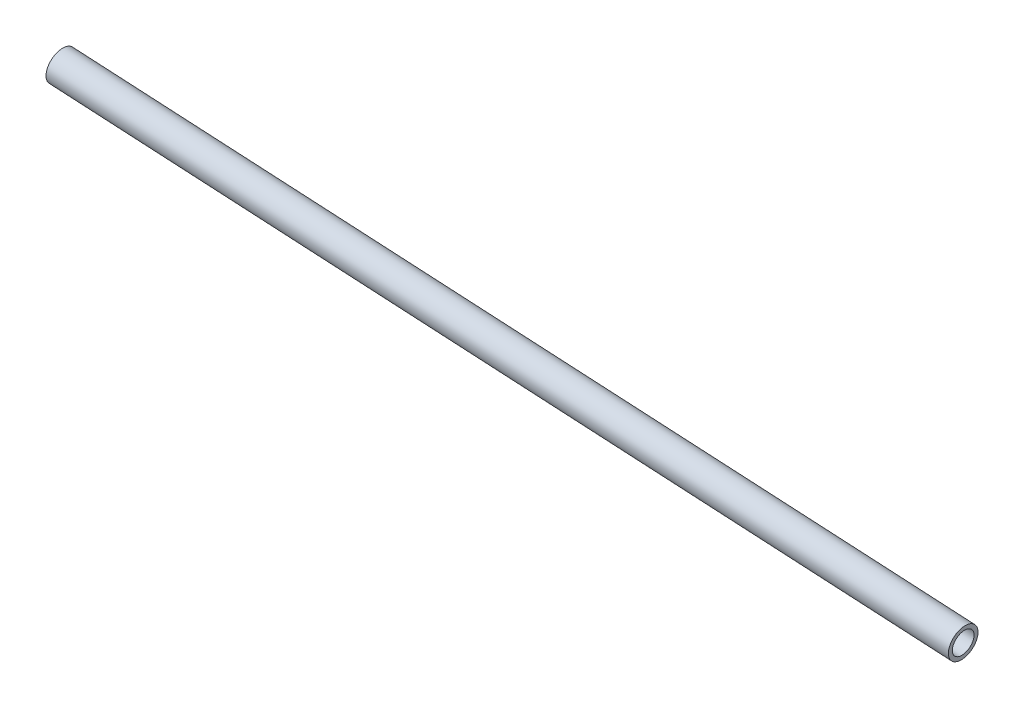
ISO-10303-21;
HEADER;
FILE_DESCRIPTION(('STEP AP214'),'2;1');
FILE_NAME('part.step','',(''),(''),'','','');
FILE_SCHEMA(('AUTOMOTIVE_DESIGN { 1 0 10303 214 1 1 1 1 }'));
ENDSEC;
DATA;
#1=APPLICATION_CONTEXT('core data for automotive mechanical design processes');
#2=APPLICATION_PROTOCOL_DEFINITION('international standard','automotive_design',2000,#1);
#3=PRODUCT_CONTEXT('',#1,'mechanical');
#4=PRODUCT('Part','Part','',(#3));
#5=PRODUCT_RELATED_PRODUCT_CATEGORY('part','',(#4));
#6=PRODUCT_DEFINITION_FORMATION('','',#4);
#7=PRODUCT_DEFINITION_CONTEXT('part definition',#1,'design');
#8=PRODUCT_DEFINITION('design','',#6,#7);
#9=PRODUCT_DEFINITION_SHAPE('','',#8);
#10=(LENGTH_UNIT() NAMED_UNIT(*) SI_UNIT(.MILLI.,.METRE.));
#11=(NAMED_UNIT(*) PLANE_ANGLE_UNIT() SI_UNIT($,.RADIAN.));
#12=(NAMED_UNIT(*) SI_UNIT($,.STERADIAN.) SOLID_ANGLE_UNIT());
#13=UNCERTAINTY_MEASURE_WITH_UNIT(LENGTH_MEASURE(1.E-05),#10,'distance_accuracy_value','');
#14=(GEOMETRIC_REPRESENTATION_CONTEXT(3) GLOBAL_UNCERTAINTY_ASSIGNED_CONTEXT((#13)) GLOBAL_UNIT_ASSIGNED_CONTEXT((#10,
#11,#12)) REPRESENTATION_CONTEXT('',''));
#15=CARTESIAN_POINT('',(0.,0.,0.));
#16=DIRECTION('',(0.,0.,1.));
#17=DIRECTION('',(1.,0.,0.));
#18=AXIS2_PLACEMENT_3D('',#15,#16,#17);
#19=CARTESIAN_POINT('',(737.463178652276,-48.7125012364313,-18.0910891039654));
#20=DIRECTION('',(-0.995519937083636,0.0886608648569889,0.0328527915374742));
#21=DIRECTION('',(-0.0887087497200819,-0.996057607632761,0.));
#22=AXIS2_PLACEMENT_3D('',#19,#20,#21);
#23=CYLINDRICAL_SURFACE('',#22,6.985);
#24=CARTESIAN_POINT('',(737.463178652276,-48.7125012364313,-18.0910891039654));
#25=DIRECTION('',(0.995519937083636,-0.0886608648569889,-0.0328527915374742));
#26=DIRECTION('',(0.0887087497200819,0.996057607632761,0.));
#27=AXIS2_PLACEMENT_3D('',#24,#25,#26);
#28=CIRCLE('',#27,6.985);
#29=CARTESIAN_POINT('',(736.843548035482,-55.6699636257462,-18.0910891039654));
#30=VERTEX_POINT('',#29);
#31=EDGE_CURVE('E56',#30,#30,#28,.T.);
#32=CARTESIAN_POINT('',(192.7225,-0.197973407305246,-0.114299999999943));
#33=DIRECTION('',(0.995519937083636,-0.0886608648569889,-0.0328527915374742));
#34=DIRECTION('',(0.0887087497200819,0.996057607632761,0.));
#35=AXIS2_PLACEMENT_3D('',#32,#33,#34);
#36=CIRCLE('',#35,6.985);
#37=CARTESIAN_POINT('',(192.102869383205,-7.15543579662009,-0.114299999999946));
#38=VERTEX_POINT('',#37);
#39=EDGE_CURVE('E63',#38,#38,#36,.T.);
#40=CARTESIAN_POINT('',(736.843548035482,-55.6699636257462,-18.0910891039654));
#41=CARTESIAN_POINT('',(731.169165966187,-55.1646039608595,-17.9038308841324));
#42=CARTESIAN_POINT('',(725.494783896893,-54.6592442959727,-17.7165726642995));
#43=CARTESIAN_POINT('',(714.146019758304,-53.6485249661993,-17.3420562246335));
#44=CARTESIAN_POINT('',(708.471637689009,-53.1431653013125,-17.1547980048005));
#45=CARTESIAN_POINT('',(697.12287355042,-52.1324459715391,-16.7802815651346));
#46=CARTESIAN_POINT('',(691.448491481125,-51.6270863066523,-16.5930233453016));
#47=CARTESIAN_POINT('',(680.099727342536,-50.6163669768789,-16.2185069056357));
#48=CARTESIAN_POINT('',(674.425345273242,-50.1110073119921,-16.0312486858027));
#49=CARTESIAN_POINT('',(663.076581134653,-49.1002879822187,-15.6567322461367));
#50=CARTESIAN_POINT('',(657.402199065358,-48.594928317332,-15.4694740263038));
#51=CARTESIAN_POINT('',(646.053434926769,-47.5842089875585,-15.0949575866378));
#52=CARTESIAN_POINT('',(640.379052857474,-47.0788493226718,-14.9076993668049));
#53=CARTESIAN_POINT('',(629.030288718885,-46.0681299928983,-14.5331829271389));
#54=CARTESIAN_POINT('',(623.355906649591,-45.5627703280116,-14.3459247073059));
#55=CARTESIAN_POINT('',(612.007142511002,-44.5520509982381,-13.97140826764));
#56=CARTESIAN_POINT('',(606.332760441707,-44.0466913333514,-13.784150047807));
#57=CARTESIAN_POINT('',(594.983996303118,-43.0359720035779,-13.4096336081411));
#58=CARTESIAN_POINT('',(589.309614233823,-42.5306123386912,-13.2223753883081));
#59=CARTESIAN_POINT('',(577.960850095234,-41.5198930089177,-12.8478589486421));
#60=CARTESIAN_POINT('',(572.28646802594,-41.014533344031,-12.6606007288092));
#61=CARTESIAN_POINT('',(560.937703887351,-40.0038140142575,-12.2860842891432));
#62=CARTESIAN_POINT('',(555.263321818056,-39.4984543493708,-12.0988260693103));
#63=CARTESIAN_POINT('',(543.914557679467,-38.4877350195974,-11.7243096296443));
#64=CARTESIAN_POINT('',(538.240175610173,-37.9823753547106,-11.5370514098113));
#65=CARTESIAN_POINT('',(526.891411471584,-36.9716560249372,-11.1625349701454));
#66=CARTESIAN_POINT('',(521.217029402289,-36.4662963600504,-10.9752767503124));
#67=CARTESIAN_POINT('',(509.8682652637,-35.455577030277,-10.6007603106465));
#68=CARTESIAN_POINT('',(504.193883194405,-34.9502173653902,-10.4135020908135));
#69=CARTESIAN_POINT('',(492.845119055816,-33.9394980356168,-10.0389856511475));
#70=CARTESIAN_POINT('',(487.170736986522,-33.4341383707301,-9.85172743131457));
#71=CARTESIAN_POINT('',(475.821972847933,-32.4234190409566,-9.47721099164862));
#72=CARTESIAN_POINT('',(470.147590778638,-31.9180593760699,-9.28995277181565));
#73=CARTESIAN_POINT('',(458.798826640049,-30.9073400462964,-8.9154363321497));
#74=CARTESIAN_POINT('',(453.124444570754,-30.4019803814097,-8.72817811231673));
#75=CARTESIAN_POINT('',(441.775680432165,-29.3912610516362,-8.35366167265078));
#76=CARTESIAN_POINT('',(436.101298362871,-28.8859013867495,-8.16640345281781));
#77=CARTESIAN_POINT('',(424.752534224282,-27.875182056976,-7.79188701315186));
#78=CARTESIAN_POINT('',(419.078152154987,-27.3698223920893,-7.60462879331889));
#79=CARTESIAN_POINT('',(407.729388016398,-26.3591030623158,-7.23011235365294));
#80=CARTESIAN_POINT('',(402.055005947103,-25.8537433974291,-7.04285413381997));
#81=CARTESIAN_POINT('',(390.706241808514,-24.8430240676556,-6.66833769415402));
#82=CARTESIAN_POINT('',(385.03185973922,-24.3376644027689,-6.48107947432104));
#83=CARTESIAN_POINT('',(373.683095600631,-23.3269450729955,-6.1065630346551));
#84=CARTESIAN_POINT('',(368.008713531336,-22.8215854081087,-5.91930481482212));
#85=CARTESIAN_POINT('',(356.659949392747,-21.8108660783353,-5.54478837515618));
#86=CARTESIAN_POINT('',(350.985567323453,-21.3055064134485,-5.3575301553232));
#87=CARTESIAN_POINT('',(339.636803184863,-20.2947870836751,-4.98301371565725));
#88=CARTESIAN_POINT('',(333.962421115569,-19.7894274187883,-4.79575549582428));
#89=CARTESIAN_POINT('',(322.61365697698,-18.7787080890149,-4.42123905615834));
#90=CARTESIAN_POINT('',(316.939274907685,-18.2733484241282,-4.23398083632536));
#91=CARTESIAN_POINT('',(305.590510769096,-17.2626290943547,-3.85946439665942));
#92=CARTESIAN_POINT('',(299.916128699802,-16.757269429468,-3.67220617682644));
#93=CARTESIAN_POINT('',(288.567364561213,-15.7465500996945,-3.2976897371605));
#94=CARTESIAN_POINT('',(282.892982491918,-15.2411904348078,-3.11043151732752));
#95=CARTESIAN_POINT('',(271.544218353329,-14.2304711050343,-2.73591507766157));
#96=CARTESIAN_POINT('',(265.869836284034,-13.7251114401476,-2.5486568578286));
#97=CARTESIAN_POINT('',(254.521072145445,-12.7143921103741,-2.17414041816265));
#98=CARTESIAN_POINT('',(248.846690076151,-12.2090324454874,-1.98688219832968));
#99=CARTESIAN_POINT('',(237.497925937562,-11.1983131157139,-1.61236575866373));
#100=CARTESIAN_POINT('',(231.823543868267,-10.6929534508272,-1.42510753883076));
#101=CARTESIAN_POINT('',(220.474779729678,-9.68223412105374,-1.05059109916482));
#102=CARTESIAN_POINT('',(214.800397660383,-9.17687445616701,-0.863332879331839));
#103=CARTESIAN_POINT('',(203.451633521794,-8.16615512639356,-0.48881643966589));
#104=CARTESIAN_POINT('',(197.7772514525,-7.66079546150682,-0.301558219832916));
#105=CARTESIAN_POINT('',(192.102869383205,-7.15543579662009,-0.114299999999946));
#106=B_SPLINE_CURVE_WITH_KNOTS('',3,(#40,#41,#42,#43,#44,#45,#46,#47,#48,#49,#50,#51,#52,#53,
#54,#55,#56,#57,#58,#59,#60,#61,#62,#63,#64,#65,#66,#67,#68,#69,#70,#71,#72,#73,#74,#75,#76,#77,
#78,#79,#80,#81,#82,#83,#84,#85,#86,#87,#88,#89,#90,#91,#92,#93,#94,#95,#96,#97,#98,#99,#100,
#101,#102,#103,#104,#105),.UNSPECIFIED.,.F.,.F.,(4,2,2,2,2,2,2,2,2,2,2,2,2,2,2,2,2,2,2,2,2,2,2,
2,2,2,2,2,2,2,2,2,4),(0.,17.0997541824756,34.199508364951,51.2992625474265,68.399016729902,
85.4987709123775,102.598525094853,119.698279277328,136.798033459804,153.89778764228,
170.997541824755,188.09729600723,205.197050189706,222.296804372181,239.396558554657,
256.496312737132,273.596066919608,290.695821102083,307.795575284559,324.895329467034,
341.99508364951,359.094837831985,376.194592014461,393.294346196936,410.394100379412,
427.493854561887,444.593608744363,461.693362926838,478.793117109314,495.892871291789,
512.992625474265,530.09237965674,547.192133839216),.UNSPECIFIED.);
#107=EDGE_CURVE('BSEAM48',#30,#38,#106,.T.);
#108=ORIENTED_EDGE('',*,*,#31,.T.);
#109=ORIENTED_EDGE('',*,*,#39,.F.);
#110=ORIENTED_EDGE('',*,*,#107,.T.);
#111=ORIENTED_EDGE('',*,*,#107,.F.);
#112=EDGE_LOOP('',(#108,#110,#109,#111));
#113=FACE_BOUND('',#112,.T.);
#114=ADVANCED_FACE('F48',(#113),#23,.F.);
#115=CARTESIAN_POINT('',(737.463178652276,-48.7125012364313,-18.0910891039654));
#116=DIRECTION('',(-0.995519937083636,0.0886608648569889,0.0328527915374742));
#117=DIRECTION('',(-0.0887087497200819,-0.996057607632761,0.));
#118=AXIS2_PLACEMENT_3D('',#115,#116,#117);
#119=CYLINDRICAL_SURFACE('',#118,9.525);
#120=CARTESIAN_POINT('',(737.463178652276,-48.7125012364313,-18.0910891039654));
#121=DIRECTION('',(0.995519937083636,-0.0886608648569889,-0.0328527915374742));
#122=DIRECTION('',(0.0887087497200819,0.996057607632761,0.));
#123=AXIS2_PLACEMENT_3D('',#120,#121,#122);
#124=CIRCLE('',#123,9.525);
#125=CARTESIAN_POINT('',(736.618227811193,-58.1999499491334,-18.0910891039654));
#126=VERTEX_POINT('',#125);
#127=EDGE_CURVE('E11',#126,#126,#124,.T.);
#128=CARTESIAN_POINT('',(192.7225,-0.197973407305246,-0.114299999999943));
#129=DIRECTION('',(0.995519937083636,-0.0886608648569889,-0.0328527915374742));
#130=DIRECTION('',(0.0887087497200819,0.996057607632761,0.));
#131=AXIS2_PLACEMENT_3D('',#128,#129,#130);
#132=CIRCLE('',#131,9.525);
#133=CARTESIAN_POINT('',(191.877549158916,-9.6854221200073,-0.114299999999946));
#134=VERTEX_POINT('',#133);
#135=EDGE_CURVE('E51',#134,#134,#132,.T.);
#136=CARTESIAN_POINT('',(736.618227811193,-58.1999499491334,-18.0910891039654));
#137=CARTESIAN_POINT('',(730.943845741898,-57.6945902842467,-17.9038308841324));
#138=CARTESIAN_POINT('',(725.269463672604,-57.1892306193599,-17.7165726642995));
#139=CARTESIAN_POINT('',(713.920699534014,-56.1785112895865,-17.3420562246335));
#140=CARTESIAN_POINT('',(708.24631746472,-55.6731516246997,-17.1547980048005));
#141=CARTESIAN_POINT('',(696.897553326131,-54.6624322949263,-16.7802815651346));
#142=CARTESIAN_POINT('',(691.223171256836,-54.1570726300396,-16.5930233453016));
#143=CARTESIAN_POINT('',(679.874407118247,-53.1463533002661,-16.2185069056357));
#144=CARTESIAN_POINT('',(674.200025048953,-52.6409936353794,-16.0312486858027));
#145=CARTESIAN_POINT('',(662.851260910364,-51.6302743056059,-15.6567322461367));
#146=CARTESIAN_POINT('',(657.176878841069,-51.1249146407192,-15.4694740263038));
#147=CARTESIAN_POINT('',(645.82811470248,-50.1141953109457,-15.0949575866378));
#148=CARTESIAN_POINT('',(640.153732633185,-49.608835646059,-14.9076993668049));
#149=CARTESIAN_POINT('',(628.804968494596,-48.5981163162855,-14.5331829271389));
#150=CARTESIAN_POINT('',(623.130586425302,-48.0927566513988,-14.3459247073059));
#151=CARTESIAN_POINT('',(611.781822286713,-47.0820373216253,-13.97140826764));
#152=CARTESIAN_POINT('',(606.107440217418,-46.5766776567386,-13.784150047807));
#153=CARTESIAN_POINT('',(594.758676078829,-45.5659583269651,-13.4096336081411));
#154=CARTESIAN_POINT('',(589.084294009534,-45.0605986620784,-13.2223753883081));
#155=CARTESIAN_POINT('',(577.735529870945,-44.049879332305,-12.8478589486421));
#156=CARTESIAN_POINT('',(572.061147801651,-43.5445196674182,-12.6606007288092));
#157=CARTESIAN_POINT('',(560.712383663062,-42.5338003376448,-12.2860842891432));
#158=CARTESIAN_POINT('',(555.038001593767,-42.028440672758,-12.0988260693103));
#159=CARTESIAN_POINT('',(543.689237455178,-41.0177213429846,-11.7243096296443));
#160=CARTESIAN_POINT('',(538.014855385884,-40.5123616780978,-11.5370514098113));
#161=CARTESIAN_POINT('',(526.666091247295,-39.5016423483244,-11.1625349701454));
#162=CARTESIAN_POINT('',(520.991709178,-38.9962826834377,-10.9752767503124));
#163=CARTESIAN_POINT('',(509.642945039411,-37.9855633536642,-10.6007603106465));
#164=CARTESIAN_POINT('',(503.968562970116,-37.4802036887775,-10.4135020908135));
#165=CARTESIAN_POINT('',(492.619798831527,-36.469484359004,-10.0389856511475));
#166=CARTESIAN_POINT('',(486.945416762233,-35.9641246941173,-9.85172743131457));
#167=CARTESIAN_POINT('',(475.596652623644,-34.9534053643438,-9.47721099164862));
#168=CARTESIAN_POINT('',(469.922270554349,-34.4480456994571,-9.28995277181565));
#169=CARTESIAN_POINT('',(458.57350641576,-33.4373263696836,-8.9154363321497));
#170=CARTESIAN_POINT('',(452.899124346465,-32.9319667047969,-8.72817811231673));
#171=CARTESIAN_POINT('',(441.550360207876,-31.9212473750234,-8.35366167265078));
#172=CARTESIAN_POINT('',(435.875978138582,-31.4158877101367,-8.16640345281781));
#173=CARTESIAN_POINT('',(424.527213999993,-30.4051683803632,-7.79188701315186));
#174=CARTESIAN_POINT('',(418.852831930698,-29.8998087154765,-7.60462879331889));
#175=CARTESIAN_POINT('',(407.504067792109,-28.889089385703,-7.23011235365294));
#176=CARTESIAN_POINT('',(401.829685722814,-28.3837297208163,-7.04285413381997));
#177=CARTESIAN_POINT('',(390.480921584225,-27.3730103910429,-6.66833769415402));
#178=CARTESIAN_POINT('',(384.806539514931,-26.8676507261561,-6.48107947432104));
#179=CARTESIAN_POINT('',(373.457775376342,-25.8569313963827,-6.1065630346551));
#180=CARTESIAN_POINT('',(367.783393307047,-25.3515717314959,-5.91930481482212));
#181=CARTESIAN_POINT('',(356.434629168458,-24.3408524017225,-5.54478837515618));
#182=CARTESIAN_POINT('',(350.760247099164,-23.8354927368357,-5.3575301553232));
#183=CARTESIAN_POINT('',(339.411482960574,-22.8247734070623,-4.98301371565725));
#184=CARTESIAN_POINT('',(333.73710089128,-22.3194137421755,-4.79575549582428));
#185=CARTESIAN_POINT('',(322.388336752691,-21.3086944124021,-4.42123905615834));
#186=CARTESIAN_POINT('',(316.713954683396,-20.8033347475154,-4.23398083632536));
#187=CARTESIAN_POINT('',(305.365190544807,-19.7926154177419,-3.85946439665942));
#188=CARTESIAN_POINT('',(299.690808475513,-19.2872557528552,-3.67220617682644));
#189=CARTESIAN_POINT('',(288.342044336924,-18.2765364230817,-3.2976897371605));
#190=CARTESIAN_POINT('',(282.667662267629,-17.771176758195,-3.11043151732752));
#191=CARTESIAN_POINT('',(271.31889812904,-16.7604574284215,-2.73591507766157));
#192=CARTESIAN_POINT('',(265.644516059745,-16.2550977635348,-2.5486568578286));
#193=CARTESIAN_POINT('',(254.295751921156,-15.2443784337613,-2.17414041816265));
#194=CARTESIAN_POINT('',(248.621369851862,-14.7390187688746,-1.98688219832968));
#195=CARTESIAN_POINT('',(237.272605713273,-13.7282994391011,-1.61236575866373));
#196=CARTESIAN_POINT('',(231.598223643978,-13.2229397742144,-1.42510753883076));
#197=CARTESIAN_POINT('',(220.249459505389,-12.212220444441,-1.05059109916482));
#198=CARTESIAN_POINT('',(214.575077436094,-11.7068607795542,-0.863332879331839));
#199=CARTESIAN_POINT('',(203.226313297505,-10.6961414497808,-0.48881643966589));
#200=CARTESIAN_POINT('',(197.551931228211,-10.190781784894,-0.301558219832916));
#201=CARTESIAN_POINT('',(191.877549158916,-9.6854221200073,-0.114299999999946));
#202=B_SPLINE_CURVE_WITH_KNOTS('',3,(#136,#137,#138,#139,#140,#141,#142,#143,#144,#145,#146,
#147,#148,#149,#150,#151,#152,#153,#154,#155,#156,#157,#158,#159,#160,#161,#162,#163,#164,#165,
#166,#167,#168,#169,#170,#171,#172,#173,#174,#175,#176,#177,#178,#179,#180,#181,#182,#183,#184,
#185,#186,#187,#188,#189,#190,#191,#192,#193,#194,#195,#196,#197,#198,#199,#200,#201),
.UNSPECIFIED.,.F.,.F.,(4,2,2,2,2,2,2,2,2,2,2,2,2,2,2,2,2,2,2,2,2,2,2,2,2,2,2,2,2,2,2,2,4),(0.,
17.0997541824756,34.199508364951,51.2992625474265,68.399016729902,85.4987709123776,
102.598525094853,119.698279277328,136.798033459804,153.89778764228,170.997541824755,
188.09729600723,205.197050189706,222.296804372181,239.396558554657,256.496312737132,
273.596066919608,290.695821102083,307.795575284559,324.895329467034,341.99508364951,
359.094837831985,376.194592014461,393.294346196936,410.394100379412,427.493854561887,
444.593608744363,461.693362926838,478.793117109314,495.892871291789,512.992625474265,
530.09237965674,547.192133839216),.UNSPECIFIED.);
#203=EDGE_CURVE('BSEAM70',#126,#134,#202,.T.);
#204=ORIENTED_EDGE('',*,*,#127,.F.);
#205=ORIENTED_EDGE('',*,*,#135,.T.);
#206=ORIENTED_EDGE('',*,*,#203,.T.);
#207=ORIENTED_EDGE('',*,*,#203,.F.);
#208=EDGE_LOOP('',(#204,#206,#205,#207));
#209=FACE_BOUND('',#208,.T.);
#210=ADVANCED_FACE('F70',(#209),#119,.T.);
#211=CARTESIAN_POINT('',(737.463178652276,-48.7125012364313,-18.0910891039654));
#212=DIRECTION('',(0.995519937083636,-0.0886608648569889,-0.0328527915374742));
#213=DIRECTION('',(0.0887087497200819,0.996057607632761,0.));
#214=AXIS2_PLACEMENT_3D('',#211,#212,#213);
#215=PLANE('',#214);
#216=ORIENTED_EDGE('',*,*,#31,.F.);
#217=EDGE_LOOP('',(#216));
#218=FACE_BOUND('',#217,.T.);
#219=ORIENTED_EDGE('',*,*,#127,.T.);
#220=EDGE_LOOP('',(#219));
#221=FACE_BOUND('',#220,.T.);
#222=ADVANCED_FACE('F74',(#218,#221),#215,.T.);
#223=CARTESIAN_POINT('',(192.7225,-0.197973407305246,-0.114299999999943));
#224=DIRECTION('',(0.995519937083636,-0.0886608648569889,-0.0328527915374742));
#225=DIRECTION('',(0.0887087497200819,0.996057607632761,0.));
#226=AXIS2_PLACEMENT_3D('',#223,#224,#225);
#227=PLANE('',#226);
#228=ORIENTED_EDGE('',*,*,#39,.T.);
#229=EDGE_LOOP('',(#228));
#230=FACE_BOUND('',#229,.T.);
#231=ORIENTED_EDGE('',*,*,#135,.F.);
#232=EDGE_LOOP('',(#231));
#233=FACE_BOUND('',#232,.T.);
#234=ADVANCED_FACE('F72',(#230,#233),#227,.F.);
#235=CLOSED_SHELL('',(#114,#210,#222,#234));
#236=MANIFOLD_SOLID_BREP('B2',#235);
#237=ADVANCED_BREP_SHAPE_REPRESENTATION('',(#18,#236),#14);
#238=SHAPE_DEFINITION_REPRESENTATION(#9,#237);
ENDSEC;
END-ISO-10303-21;
